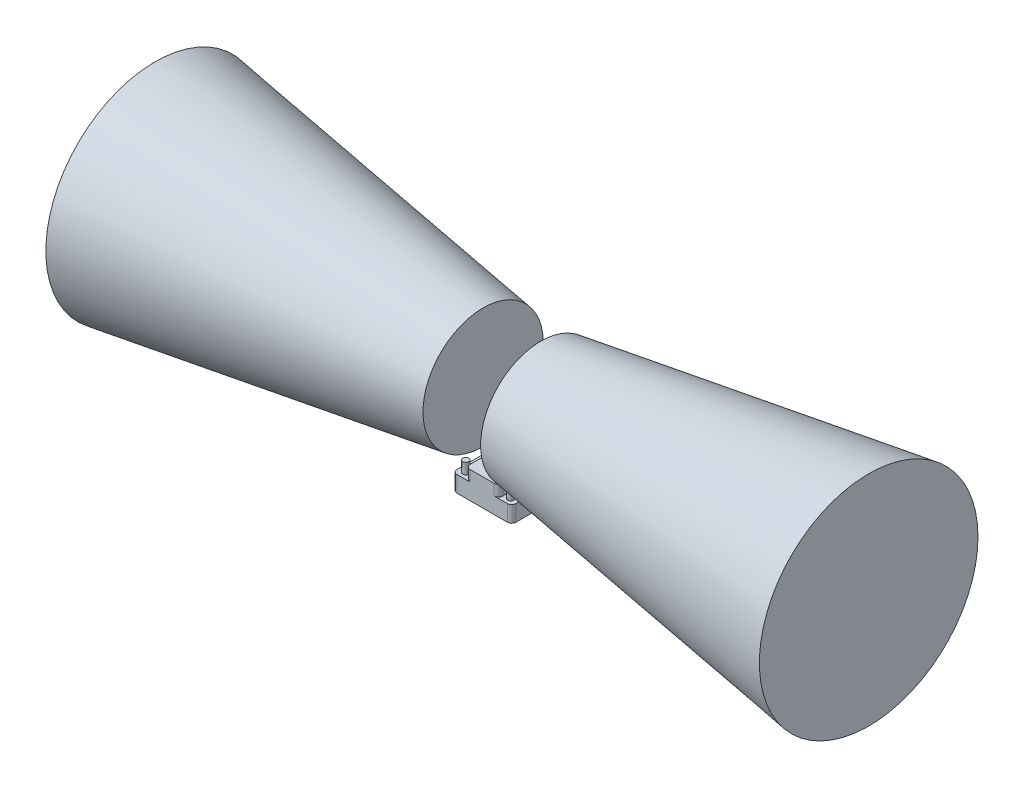
ISO-10303-21;
HEADER;
FILE_DESCRIPTION(('STEP AP214'),'2;1');
FILE_NAME('part.step','',(''),(''),'','','');
FILE_SCHEMA(('AUTOMOTIVE_DESIGN { 1 0 10303 214 1 1 1 1 }'));
ENDSEC;
DATA;
#1=APPLICATION_CONTEXT('core data for automotive mechanical design processes');
#2=APPLICATION_PROTOCOL_DEFINITION('international standard','automotive_design',2000,#1);
#3=PRODUCT_CONTEXT('',#1,'mechanical');
#4=PRODUCT('Part','Part','',(#3));
#5=PRODUCT_RELATED_PRODUCT_CATEGORY('part','',(#4));
#6=PRODUCT_DEFINITION_FORMATION('','',#4);
#7=PRODUCT_DEFINITION_CONTEXT('part definition',#1,'design');
#8=PRODUCT_DEFINITION('design','',#6,#7);
#9=PRODUCT_DEFINITION_SHAPE('','',#8);
#10=(LENGTH_UNIT() NAMED_UNIT(*) SI_UNIT(.MILLI.,.METRE.));
#11=(NAMED_UNIT(*) PLANE_ANGLE_UNIT() SI_UNIT($,.RADIAN.));
#12=(NAMED_UNIT(*) SI_UNIT($,.STERADIAN.) SOLID_ANGLE_UNIT());
#13=UNCERTAINTY_MEASURE_WITH_UNIT(LENGTH_MEASURE(1.E-05),#10,'distance_accuracy_value','');
#14=(GEOMETRIC_REPRESENTATION_CONTEXT(3) GLOBAL_UNCERTAINTY_ASSIGNED_CONTEXT((#13)) GLOBAL_UNIT_ASSIGNED_CONTEXT((#10,
#11,#12)) REPRESENTATION_CONTEXT('',''));
#15=CARTESIAN_POINT('',(0.,0.,0.));
#16=DIRECTION('',(0.,0.,1.));
#17=DIRECTION('',(1.,0.,0.));
#18=AXIS2_PLACEMENT_3D('',#15,#16,#17);
#19=CARTESIAN_POINT('',(26.3746088859546,66.5,10.));
#20=DIRECTION('',(-1.,0.,0.));
#21=DIRECTION('',(0.,0.,1.));
#22=AXIS2_PLACEMENT_3D('',#19,#20,#21);
#23=PLANE('',#22);
#24=CARTESIAN_POINT('',(26.3746088859546,66.5,10.));
#25=DIRECTION('',(1.,0.,0.));
#26=DIRECTION('',(0.,0.,-1.));
#27=AXIS2_PLACEMENT_3D('',#24,#25,#26);
#28=CIRCLE('',#27,55.);
#29=CARTESIAN_POINT('',(26.3746088859546,66.5,-45.));
#30=VERTEX_POINT('',#29);
#31=EDGE_CURVE('E11',#30,#30,#28,.T.);
#32=ORIENTED_EDGE('',*,*,#31,.F.);
#33=EDGE_LOOP('',(#32));
#34=FACE_BOUND('',#33,.T.);
#35=ADVANCED_FACE('F39',(#34),#23,.T.);
#36=CARTESIAN_POINT('',(326.374608885955,66.5,10.));
#37=DIRECTION('',(1.,0.,0.));
#38=DIRECTION('',(0.,0.,-1.));
#39=AXIS2_PLACEMENT_3D('',#36,#37,#38);
#40=CONICAL_SURFACE('',#39,100.,0.148889947609497);
#41=ORIENTED_EDGE('',*,*,#31,.T.);
#42=EDGE_LOOP('',(#41));
#43=FACE_BOUND('',#42,.T.);
#44=CARTESIAN_POINT('',(326.374608885955,66.5,10.));
#45=DIRECTION('',(1.,0.,0.));
#46=DIRECTION('',(0.,0.,-1.));
#47=AXIS2_PLACEMENT_3D('',#44,#45,#46);
#48=CIRCLE('',#47,100.);
#49=CARTESIAN_POINT('',(326.374608885955,66.5,-90.));
#50=VERTEX_POINT('',#49);
#51=EDGE_CURVE('E45',#50,#50,#48,.T.);
#52=ORIENTED_EDGE('',*,*,#51,.F.);
#53=EDGE_LOOP('',(#52));
#54=FACE_BOUND('',#53,.T.);
#55=ADVANCED_FACE('F53',(#43,#54),#40,.T.);
#56=CARTESIAN_POINT('',(326.374608885955,166.5,10.));
#57=DIRECTION('',(1.,0.,0.));
#58=DIRECTION('',(0.,0.,-1.));
#59=AXIS2_PLACEMENT_3D('',#56,#57,#58);
#60=PLANE('',#59);
#61=ORIENTED_EDGE('',*,*,#51,.T.);
#62=EDGE_LOOP('',(#61));
#63=FACE_BOUND('',#62,.T.);
#64=ADVANCED_FACE('F51',(#63),#60,.T.);
#65=CLOSED_SHELL('',(#35,#55,#64));
#66=MANIFOLD_SOLID_BREP('B2',#65);
#67=CARTESIAN_POINT('',(-26.3746088859546,66.5,10.));
#68=DIRECTION('',(1.,0.,0.));
#69=DIRECTION('',(0.,0.,-1.));
#70=AXIS2_PLACEMENT_3D('',#67,#68,#69);
#71=PLANE('',#70);
#72=CARTESIAN_POINT('',(-26.3746088859546,66.5,10.));
#73=DIRECTION('',(1.,0.,0.));
#74=DIRECTION('',(0.,0.,-1.));
#75=AXIS2_PLACEMENT_3D('',#72,#73,#74);
#76=CIRCLE('',#75,55.);
#77=CARTESIAN_POINT('',(-26.3746088859546,66.5,-45.));
#78=VERTEX_POINT('',#77);
#79=EDGE_CURVE('E38',#78,#78,#76,.T.);
#80=ORIENTED_EDGE('',*,*,#79,.T.);
#81=EDGE_LOOP('',(#80));
#82=FACE_BOUND('',#81,.T.);
#83=ADVANCED_FACE('F88',(#82),#71,.T.);
#84=CARTESIAN_POINT('',(-26.3746088859546,66.5,10.));
#85=DIRECTION('',(-1.,0.,0.));
#86=DIRECTION('',(0.,0.,1.));
#87=AXIS2_PLACEMENT_3D('',#84,#85,#86);
#88=CONICAL_SURFACE('',#87,55.,0.148889947609497);
#89=CARTESIAN_POINT('',(-326.374608885955,66.5,10.));
#90=DIRECTION('',(1.,0.,0.));
#91=DIRECTION('',(0.,0.,-1.));
#92=AXIS2_PLACEMENT_3D('',#89,#90,#91);
#93=CIRCLE('',#92,100.);
#94=CARTESIAN_POINT('',(-326.374608885955,66.5,-90.));
#95=VERTEX_POINT('',#94);
#96=EDGE_CURVE('E94',#95,#95,#93,.T.);
#97=ORIENTED_EDGE('',*,*,#96,.T.);
#98=EDGE_LOOP('',(#97));
#99=FACE_BOUND('',#98,.T.);
#100=ORIENTED_EDGE('',*,*,#79,.F.);
#101=EDGE_LOOP('',(#100));
#102=FACE_BOUND('',#101,.T.);
#103=ADVANCED_FACE('F100',(#99,#102),#88,.T.);
#104=CARTESIAN_POINT('',(-326.374608885955,166.5,10.));
#105=DIRECTION('',(-1.,0.,0.));
#106=DIRECTION('',(0.,0.,1.));
#107=AXIS2_PLACEMENT_3D('',#104,#105,#106);
#108=PLANE('',#107);
#109=ORIENTED_EDGE('',*,*,#96,.F.);
#110=EDGE_LOOP('',(#109));
#111=FACE_BOUND('',#110,.T.);
#112=ADVANCED_FACE('F103',(#111),#108,.T.);
#113=CLOSED_SHELL('',(#83,#103,#112));
#114=MANIFOLD_SOLID_BREP('B6',#113);
#115=CARTESIAN_POINT('',(-23.,4.8,33.25));
#116=DIRECTION('',(0.,-1.,0.));
#117=DIRECTION('',(0.,0.,-1.));
#118=AXIS2_PLACEMENT_3D('',#115,#116,#117);
#119=PLANE('',#118);
#120=CARTESIAN_POINT('',(-20.5499999999999,4.8,-21.6250000000001));
#121=DIRECTION('',(0.,-1.,0.));
#122=DIRECTION('',(0.,0.,-1.));
#123=AXIS2_PLACEMENT_3D('',#120,#121,#122);
#124=CIRCLE('',#123,2.74999999999999);
#125=CARTESIAN_POINT('',(-20.5499999999999,4.8,-24.3750000000001));
#126=VERTEX_POINT('',#125);
#127=EDGE_CURVE('E136',#126,#126,#124,.F.);
#128=ORIENTED_EDGE('',*,*,#127,.F.);
#129=EDGE_LOOP('',(#128));
#130=FACE_BOUND('',#129,.T.);
#131=CARTESIAN_POINT('',(-20.5499999999999,4.8,31.6249999999999));
#132=DIRECTION('',(0.,-1.,0.));
#133=DIRECTION('',(0.,0.,-1.));
#134=AXIS2_PLACEMENT_3D('',#131,#132,#133);
#135=CIRCLE('',#134,2.74999999999999);
#136=CARTESIAN_POINT('',(-20.5499999999999,4.8,28.8749999999999));
#137=VERTEX_POINT('',#136);
#138=EDGE_CURVE('E336',#137,#137,#135,.F.);
#139=ORIENTED_EDGE('',*,*,#138,.F.);
#140=EDGE_LOOP('',(#139));
#141=FACE_BOUND('',#140,.T.);
#142=CARTESIAN_POINT('',(-11.,4.8,33.25));
#143=DIRECTION('',(0.,1.,0.));
#144=DIRECTION('',(0.,0.,-1.));
#145=AXIS2_PLACEMENT_3D('',#142,#143,#144);
#146=CIRCLE('',#145,4.);
#147=CARTESIAN_POINT('',(-15.,4.8,33.25));
#148=VERTEX_POINT('',#147);
#149=CARTESIAN_POINT('',(-11.,4.8,37.25));
#150=VERTEX_POINT('',#149);
#151=EDGE_CURVE('E143',#148,#150,#146,.T.);
#152=ORIENTED_EDGE('',*,*,#151,.F.);
#153=DIRECTION('',(0.,0.,1.));
#154=VECTOR('',#153,1.);
#155=CARTESIAN_POINT('',(-15.,4.8,33.25));
#156=LINE('',#155,#154);
#157=CARTESIAN_POINT('',(-15.,4.8,-33.25));
#158=VERTEX_POINT('',#157);
#159=EDGE_CURVE('E147',#158,#148,#156,.T.);
#160=ORIENTED_EDGE('',*,*,#159,.F.);
#161=CARTESIAN_POINT('',(-11.,4.8,-33.25));
#162=DIRECTION('',(0.,1.,0.));
#163=DIRECTION('',(0.,0.,-1.));
#164=AXIS2_PLACEMENT_3D('',#161,#162,#163);
#165=CIRCLE('',#164,4.);
#166=CARTESIAN_POINT('',(-11.,4.8,-37.25));
#167=VERTEX_POINT('',#166);
#168=EDGE_CURVE('E561',#167,#158,#165,.T.);
#169=ORIENTED_EDGE('',*,*,#168,.F.);
#170=DIRECTION('',(-1.,0.,0.));
#171=VECTOR('',#170,1.);
#172=CARTESIAN_POINT('',(-23.,4.8,-37.25));
#173=LINE('',#172,#171);
#174=CARTESIAN_POINT('',(-23.,4.8,-37.25));
#175=VERTEX_POINT('',#174);
#176=EDGE_CURVE('E283',#167,#175,#173,.T.);
#177=ORIENTED_EDGE('',*,*,#176,.T.);
#178=CARTESIAN_POINT('',(-23.,4.8,-33.25));
#179=DIRECTION('',(0.,1.,0.));
#180=DIRECTION('',(0.,0.,-1.));
#181=AXIS2_PLACEMENT_3D('',#178,#179,#180);
#182=CIRCLE('',#181,4.);
#183=CARTESIAN_POINT('',(-27.,4.8,-33.25));
#184=VERTEX_POINT('',#183);
#185=EDGE_CURVE('E286',#175,#184,#182,.T.);
#186=ORIENTED_EDGE('',*,*,#185,.T.);
#187=DIRECTION('',(0.,0.,1.));
#188=VECTOR('',#187,1.);
#189=CARTESIAN_POINT('',(-27.,4.8,33.25));
#190=LINE('',#189,#188);
#191=CARTESIAN_POINT('',(-27.,4.8,33.25));
#192=VERTEX_POINT('',#191);
#193=EDGE_CURVE('E289',#184,#192,#190,.T.);
#194=ORIENTED_EDGE('',*,*,#193,.T.);
#195=CARTESIAN_POINT('',(-23.,4.8,33.25));
#196=DIRECTION('',(0.,1.,0.));
#197=DIRECTION('',(0.,0.,-1.));
#198=AXIS2_PLACEMENT_3D('',#195,#196,#197);
#199=CIRCLE('',#198,4.);
#200=CARTESIAN_POINT('',(-23.,4.8,37.25));
#201=VERTEX_POINT('',#200);
#202=EDGE_CURVE('E263',#192,#201,#199,.T.);
#203=ORIENTED_EDGE('',*,*,#202,.T.);
#204=DIRECTION('',(1.,0.,0.));
#205=VECTOR('',#204,1.);
#206=CARTESIAN_POINT('',(-23.,4.8,37.25));
#207=LINE('',#206,#205);
#208=EDGE_CURVE('E272',#201,#150,#207,.T.);
#209=ORIENTED_EDGE('',*,*,#208,.T.);
#210=EDGE_LOOP('',(#152,#160,#169,#177,#186,#194,#203,#209));
#211=FACE_BOUND('',#210,.T.);
#212=ADVANCED_FACE('F128',(#130,#141,#211),#119,.F.);
#213=CARTESIAN_POINT('',(-23.,-10.,33.25));
#214=DIRECTION('',(0.,1.,0.));
#215=DIRECTION('',(0.,0.,1.));
#216=AXIS2_PLACEMENT_3D('',#213,#214,#215);
#217=CYLINDRICAL_SURFACE('',#216,4.);
#218=DIRECTION('',(0.,1.,0.));
#219=VECTOR('',#218,1.);
#220=CARTESIAN_POINT('',(-23.,-10.,37.25));
#221=LINE('',#220,#219);
#222=CARTESIAN_POINT('',(-23.,-10.,37.25));
#223=VERTEX_POINT('',#222);
#224=EDGE_CURVE('E316',#223,#201,#221,.T.);
#225=ORIENTED_EDGE('',*,*,#224,.T.);
#226=ORIENTED_EDGE('',*,*,#202,.F.);
#227=DIRECTION('',(0.,1.,0.));
#228=VECTOR('',#227,1.);
#229=CARTESIAN_POINT('',(-27.,-10.,33.25));
#230=LINE('',#229,#228);
#231=CARTESIAN_POINT('',(-27.,-10.,33.25));
#232=VERTEX_POINT('',#231);
#233=EDGE_CURVE('E317',#232,#192,#230,.T.);
#234=ORIENTED_EDGE('',*,*,#233,.F.);
#235=CARTESIAN_POINT('',(-23.,-10.,33.25));
#236=DIRECTION('',(0.,1.,0.));
#237=DIRECTION('',(0.,0.,-1.));
#238=AXIS2_PLACEMENT_3D('',#235,#236,#237);
#239=CIRCLE('',#238,4.);
#240=EDGE_CURVE('E292',#232,#223,#239,.T.);
#241=ORIENTED_EDGE('',*,*,#240,.T.);
#242=EDGE_LOOP('',(#225,#226,#234,#241));
#243=FACE_BOUND('',#242,.T.);
#244=ADVANCED_FACE('F130',(#243),#217,.T.);
#245=CARTESIAN_POINT('',(-27.,-10.,33.25));
#246=DIRECTION('',(-1.,0.,0.));
#247=DIRECTION('',(0.,0.,1.));
#248=AXIS2_PLACEMENT_3D('',#245,#246,#247);
#249=PLANE('',#248);
#250=ORIENTED_EDGE('',*,*,#233,.T.);
#251=ORIENTED_EDGE('',*,*,#193,.F.);
#252=DIRECTION('',(0.,1.,0.));
#253=VECTOR('',#252,1.);
#254=CARTESIAN_POINT('',(-27.,-10.,-33.25));
#255=LINE('',#254,#253);
#256=CARTESIAN_POINT('',(-27.,-10.,-33.25));
#257=VERTEX_POINT('',#256);
#258=EDGE_CURVE('E320',#257,#184,#255,.T.);
#259=ORIENTED_EDGE('',*,*,#258,.F.);
#260=DIRECTION('',(0.,0.,1.));
#261=VECTOR('',#260,1.);
#262=CARTESIAN_POINT('',(-27.,-10.,33.25));
#263=LINE('',#262,#261);
#264=EDGE_CURVE('E313',#257,#232,#263,.T.);
#265=ORIENTED_EDGE('',*,*,#264,.T.);
#266=EDGE_LOOP('',(#250,#251,#259,#265));
#267=FACE_BOUND('',#266,.T.);
#268=ADVANCED_FACE('F400',(#267),#249,.T.);
#269=CARTESIAN_POINT('',(-23.,-10.,-33.25));
#270=DIRECTION('',(0.,1.,0.));
#271=DIRECTION('',(0.,0.,1.));
#272=AXIS2_PLACEMENT_3D('',#269,#270,#271);
#273=CYLINDRICAL_SURFACE('',#272,4.);
#274=ORIENTED_EDGE('',*,*,#258,.T.);
#275=ORIENTED_EDGE('',*,*,#185,.F.);
#276=DIRECTION('',(0.,1.,0.));
#277=VECTOR('',#276,1.);
#278=CARTESIAN_POINT('',(-23.,-10.,-37.25));
#279=LINE('',#278,#277);
#280=CARTESIAN_POINT('',(-23.,-10.,-37.25));
#281=VERTEX_POINT('',#280);
#282=EDGE_CURVE('E322',#281,#175,#279,.T.);
#283=ORIENTED_EDGE('',*,*,#282,.F.);
#284=CARTESIAN_POINT('',(-23.,-10.,-33.25));
#285=DIRECTION('',(0.,1.,0.));
#286=DIRECTION('',(0.,0.,-1.));
#287=AXIS2_PLACEMENT_3D('',#284,#285,#286);
#288=CIRCLE('',#287,4.);
#289=EDGE_CURVE('E310',#281,#257,#288,.T.);
#290=ORIENTED_EDGE('',*,*,#289,.T.);
#291=EDGE_LOOP('',(#274,#275,#283,#290));
#292=FACE_BOUND('',#291,.T.);
#293=ADVANCED_FACE('F403',(#292),#273,.T.);
#294=CARTESIAN_POINT('',(-23.,-10.,-37.25));
#295=DIRECTION('',(0.,0.,-1.));
#296=DIRECTION('',(-1.,0.,0.));
#297=AXIS2_PLACEMENT_3D('',#294,#295,#296);
#298=PLANE('',#297);
#299=ORIENTED_EDGE('',*,*,#282,.T.);
#300=ORIENTED_EDGE('',*,*,#176,.F.);
#301=DIRECTION('',(0.,-1.,0.));
#302=VECTOR('',#301,1.);
#303=CARTESIAN_POINT('',(-11.,14.8,-37.25));
#304=LINE('',#303,#302);
#305=CARTESIAN_POINT('',(-11.,14.8,-37.25));
#306=VERTEX_POINT('',#305);
#307=EDGE_CURVE('E568',#306,#167,#304,.T.);
#308=ORIENTED_EDGE('',*,*,#307,.F.);
#309=DIRECTION('',(-1.,0.,0.));
#310=VECTOR('',#309,1.);
#311=CARTESIAN_POINT('',(-11.,14.8,-37.25));
#312=LINE('',#311,#310);
#313=CARTESIAN_POINT('',(11.,14.8,-37.25));
#314=VERTEX_POINT('',#313);
#315=EDGE_CURVE('E545',#314,#306,#312,.T.);
#316=ORIENTED_EDGE('',*,*,#315,.F.);
#317=DIRECTION('',(0.,-1.,0.));
#318=VECTOR('',#317,1.);
#319=CARTESIAN_POINT('',(11.,14.8,-37.25));
#320=LINE('',#319,#318);
#321=CARTESIAN_POINT('',(11.,4.8,-37.25));
#322=VERTEX_POINT('',#321);
#323=EDGE_CURVE('E571',#314,#322,#320,.T.);
#324=ORIENTED_EDGE('',*,*,#323,.T.);
#325=CARTESIAN_POINT('',(23.,4.8,-37.25));
#326=VERTEX_POINT('',#325);
#327=EDGE_CURVE('E284',#326,#322,#173,.T.);
#328=ORIENTED_EDGE('',*,*,#327,.F.);
#329=DIRECTION('',(0.,1.,0.));
#330=VECTOR('',#329,1.);
#331=CARTESIAN_POINT('',(23.,-10.,-37.25));
#332=LINE('',#331,#330);
#333=CARTESIAN_POINT('',(23.,-10.,-37.25));
#334=VERTEX_POINT('',#333);
#335=EDGE_CURVE('E325',#334,#326,#332,.T.);
#336=ORIENTED_EDGE('',*,*,#335,.F.);
#337=DIRECTION('',(-1.,0.,0.));
#338=VECTOR('',#337,1.);
#339=CARTESIAN_POINT('',(-23.,-10.,-37.25));
#340=LINE('',#339,#338);
#341=EDGE_CURVE('E307',#334,#281,#340,.T.);
#342=ORIENTED_EDGE('',*,*,#341,.T.);
#343=EDGE_LOOP('',(#299,#300,#308,#316,#324,#328,#336,#342));
#344=FACE_BOUND('',#343,.T.);
#345=ADVANCED_FACE('F407',(#344),#298,.T.);
#346=CARTESIAN_POINT('',(23.,-10.,-33.25));
#347=DIRECTION('',(0.,1.,0.));
#348=DIRECTION('',(0.,0.,1.));
#349=AXIS2_PLACEMENT_3D('',#346,#347,#348);
#350=CYLINDRICAL_SURFACE('',#349,4.);
#351=ORIENTED_EDGE('',*,*,#335,.T.);
#352=CARTESIAN_POINT('',(23.,4.8,-33.25));
#353=DIRECTION('',(0.,1.,0.));
#354=DIRECTION('',(0.,0.,-1.));
#355=AXIS2_PLACEMENT_3D('',#352,#353,#354);
#356=CIRCLE('',#355,4.);
#357=CARTESIAN_POINT('',(27.,4.8,-33.25));
#358=VERTEX_POINT('',#357);
#359=EDGE_CURVE('E280',#358,#326,#356,.T.);
#360=ORIENTED_EDGE('',*,*,#359,.F.);
#361=DIRECTION('',(0.,1.,0.));
#362=VECTOR('',#361,1.);
#363=CARTESIAN_POINT('',(27.,-10.,-33.25));
#364=LINE('',#363,#362);
#365=CARTESIAN_POINT('',(27.,-10.,-33.25));
#366=VERTEX_POINT('',#365);
#367=EDGE_CURVE('E327',#366,#358,#364,.T.);
#368=ORIENTED_EDGE('',*,*,#367,.F.);
#369=CARTESIAN_POINT('',(23.,-10.,-33.25));
#370=DIRECTION('',(0.,1.,0.));
#371=DIRECTION('',(0.,0.,-1.));
#372=AXIS2_PLACEMENT_3D('',#369,#370,#371);
#373=CIRCLE('',#372,4.);
#374=EDGE_CURVE('E304',#366,#334,#373,.T.);
#375=ORIENTED_EDGE('',*,*,#374,.T.);
#376=EDGE_LOOP('',(#351,#360,#368,#375));
#377=FACE_BOUND('',#376,.T.);
#378=ADVANCED_FACE('F411',(#377),#350,.T.);
#379=CARTESIAN_POINT('',(27.,-10.,33.25));
#380=DIRECTION('',(1.,0.,0.));
#381=DIRECTION('',(0.,0.,-1.));
#382=AXIS2_PLACEMENT_3D('',#379,#380,#381);
#383=PLANE('',#382);
#384=ORIENTED_EDGE('',*,*,#367,.T.);
#385=DIRECTION('',(0.,0.,-1.));
#386=VECTOR('',#385,1.);
#387=CARTESIAN_POINT('',(27.,4.8,33.25));
#388=LINE('',#387,#386);
#389=CARTESIAN_POINT('',(27.,4.8,33.25));
#390=VERTEX_POINT('',#389);
#391=EDGE_CURVE('E277',#390,#358,#388,.T.);
#392=ORIENTED_EDGE('',*,*,#391,.F.);
#393=DIRECTION('',(0.,1.,0.));
#394=VECTOR('',#393,1.);
#395=CARTESIAN_POINT('',(27.,-10.,33.25));
#396=LINE('',#395,#394);
#397=CARTESIAN_POINT('',(27.,-10.,33.25));
#398=VERTEX_POINT('',#397);
#399=EDGE_CURVE('E329',#398,#390,#396,.T.);
#400=ORIENTED_EDGE('',*,*,#399,.F.);
#401=DIRECTION('',(0.,0.,-1.));
#402=VECTOR('',#401,1.);
#403=CARTESIAN_POINT('',(27.,-10.,33.25));
#404=LINE('',#403,#402);
#405=EDGE_CURVE('E301',#398,#366,#404,.T.);
#406=ORIENTED_EDGE('',*,*,#405,.T.);
#407=EDGE_LOOP('',(#384,#392,#400,#406));
#408=FACE_BOUND('',#407,.T.);
#409=ADVANCED_FACE('F415',(#408),#383,.T.);
#410=CARTESIAN_POINT('',(23.,-10.,33.25));
#411=DIRECTION('',(0.,1.,0.));
#412=DIRECTION('',(0.,0.,1.));
#413=AXIS2_PLACEMENT_3D('',#410,#411,#412);
#414=CYLINDRICAL_SURFACE('',#413,4.);
#415=ORIENTED_EDGE('',*,*,#399,.T.);
#416=CARTESIAN_POINT('',(23.,4.8,33.25));
#417=DIRECTION('',(0.,1.,0.));
#418=DIRECTION('',(0.,0.,1.));
#419=AXIS2_PLACEMENT_3D('',#416,#417,#418);
#420=CIRCLE('',#419,4.);
#421=CARTESIAN_POINT('',(23.,4.8,37.25));
#422=VERTEX_POINT('',#421);
#423=EDGE_CURVE('E274',#422,#390,#420,.T.);
#424=ORIENTED_EDGE('',*,*,#423,.F.);
#425=DIRECTION('',(0.,1.,0.));
#426=VECTOR('',#425,1.);
#427=CARTESIAN_POINT('',(23.,-10.,37.25));
#428=LINE('',#427,#426);
#429=CARTESIAN_POINT('',(23.,-10.,37.25));
#430=VERTEX_POINT('',#429);
#431=EDGE_CURVE('E331',#430,#422,#428,.T.);
#432=ORIENTED_EDGE('',*,*,#431,.F.);
#433=CARTESIAN_POINT('',(23.,-10.,33.25));
#434=DIRECTION('',(0.,1.,0.));
#435=DIRECTION('',(0.,0.,1.));
#436=AXIS2_PLACEMENT_3D('',#433,#434,#435);
#437=CIRCLE('',#436,4.);
#438=EDGE_CURVE('E298',#430,#398,#437,.T.);
#439=ORIENTED_EDGE('',*,*,#438,.T.);
#440=EDGE_LOOP('',(#415,#424,#432,#439));
#441=FACE_BOUND('',#440,.T.);
#442=ADVANCED_FACE('F419',(#441),#414,.T.);
#443=CARTESIAN_POINT('',(-23.,-10.,37.25));
#444=DIRECTION('',(0.,0.,1.));
#445=DIRECTION('',(1.,0.,0.));
#446=AXIS2_PLACEMENT_3D('',#443,#444,#445);
#447=PLANE('',#446);
#448=ORIENTED_EDGE('',*,*,#431,.T.);
#449=CARTESIAN_POINT('',(11.,4.8,37.25));
#450=VERTEX_POINT('',#449);
#451=EDGE_CURVE('E266',#450,#422,#207,.T.);
#452=ORIENTED_EDGE('',*,*,#451,.F.);
#453=DIRECTION('',(0.,-1.,0.));
#454=VECTOR('',#453,1.);
#455=CARTESIAN_POINT('',(11.,14.8,37.25));
#456=LINE('',#455,#454);
#457=CARTESIAN_POINT('',(11.,14.8,37.25));
#458=VERTEX_POINT('',#457);
#459=EDGE_CURVE('E248',#458,#450,#456,.T.);
#460=ORIENTED_EDGE('',*,*,#459,.F.);
#461=DIRECTION('',(1.,0.,0.));
#462=VECTOR('',#461,1.);
#463=CARTESIAN_POINT('',(-11.,14.8,37.25));
#464=LINE('',#463,#462);
#465=CARTESIAN_POINT('',(-11.,14.8,37.25));
#466=VERTEX_POINT('',#465);
#467=EDGE_CURVE('E239',#466,#458,#464,.T.);
#468=ORIENTED_EDGE('',*,*,#467,.F.);
#469=DIRECTION('',(0.,-1.,0.));
#470=VECTOR('',#469,1.);
#471=CARTESIAN_POINT('',(-11.,14.8,37.25));
#472=LINE('',#471,#470);
#473=EDGE_CURVE('E245',#466,#150,#472,.T.);
#474=ORIENTED_EDGE('',*,*,#473,.T.);
#475=ORIENTED_EDGE('',*,*,#208,.F.);
#476=ORIENTED_EDGE('',*,*,#224,.F.);
#477=DIRECTION('',(1.,0.,0.));
#478=VECTOR('',#477,1.);
#479=CARTESIAN_POINT('',(-23.,-10.,37.25));
#480=LINE('',#479,#478);
#481=EDGE_CURVE('E295',#223,#430,#480,.T.);
#482=ORIENTED_EDGE('',*,*,#481,.T.);
#483=EDGE_LOOP('',(#448,#452,#460,#468,#474,#475,#476,#482));
#484=FACE_BOUND('',#483,.T.);
#485=ADVANCED_FACE('F242',(#484),#447,.T.);
#486=CARTESIAN_POINT('',(-23.,-10.,33.25));
#487=DIRECTION('',(0.,-1.,0.));
#488=DIRECTION('',(0.,0.,-1.));
#489=AXIS2_PLACEMENT_3D('',#486,#487,#488);
#490=PLANE('',#489);
#491=ORIENTED_EDGE('',*,*,#240,.F.);
#492=ORIENTED_EDGE('',*,*,#264,.F.);
#493=ORIENTED_EDGE('',*,*,#289,.F.);
#494=ORIENTED_EDGE('',*,*,#341,.F.);
#495=ORIENTED_EDGE('',*,*,#374,.F.);
#496=ORIENTED_EDGE('',*,*,#405,.F.);
#497=ORIENTED_EDGE('',*,*,#438,.F.);
#498=ORIENTED_EDGE('',*,*,#481,.F.);
#499=EDGE_LOOP('',(#491,#492,#493,#494,#495,#496,#497,#498));
#500=FACE_BOUND('',#499,.T.);
#501=ADVANCED_FACE('F395',(#500),#490,.T.);
#502=CARTESIAN_POINT('',(20.5500000000002,4.8,-21.6250000000001));
#503=DIRECTION('',(0.,-1.,0.));
#504=DIRECTION('',(0.,0.,-1.));
#505=AXIS2_PLACEMENT_3D('',#502,#503,#504);
#506=CIRCLE('',#505,2.74999999999998);
#507=CARTESIAN_POINT('',(20.5500000000002,4.8,-24.3750000000001));
#508=VERTEX_POINT('',#507);
#509=EDGE_CURVE('E86',#508,#508,#506,.F.);
#510=ORIENTED_EDGE('',*,*,#509,.F.);
#511=EDGE_LOOP('',(#510));
#512=FACE_BOUND('',#511,.T.);
#513=CARTESIAN_POINT('',(20.5500000000002,4.8,31.6249999999999));
#514=DIRECTION('',(0.,-1.,0.));
#515=DIRECTION('',(0.,0.,-1.));
#516=AXIS2_PLACEMENT_3D('',#513,#514,#515);
#517=CIRCLE('',#516,2.74999999999998);
#518=CARTESIAN_POINT('',(20.5500000000002,4.8,28.8749999999999));
#519=VERTEX_POINT('',#518);
#520=EDGE_CURVE('E319',#519,#519,#517,.F.);
#521=ORIENTED_EDGE('',*,*,#520,.F.);
#522=EDGE_LOOP('',(#521));
#523=FACE_BOUND('',#522,.T.);
#524=CARTESIAN_POINT('',(11.,4.8,-33.25));
#525=DIRECTION('',(0.,1.,0.));
#526=DIRECTION('',(0.,0.,-1.));
#527=AXIS2_PLACEMENT_3D('',#524,#525,#526);
#528=CIRCLE('',#527,4.);
#529=CARTESIAN_POINT('',(15.,4.8,-33.25));
#530=VERTEX_POINT('',#529);
#531=EDGE_CURVE('E558',#530,#322,#528,.T.);
#532=ORIENTED_EDGE('',*,*,#531,.F.);
#533=DIRECTION('',(0.,0.,-1.));
#534=VECTOR('',#533,1.);
#535=CARTESIAN_POINT('',(15.,4.8,33.25));
#536=LINE('',#535,#534);
#537=CARTESIAN_POINT('',(15.,4.8,33.25));
#538=VERTEX_POINT('',#537);
#539=EDGE_CURVE('E555',#538,#530,#536,.T.);
#540=ORIENTED_EDGE('',*,*,#539,.F.);
#541=CARTESIAN_POINT('',(11.,4.8,33.25));
#542=DIRECTION('',(0.,1.,0.));
#543=DIRECTION('',(0.,0.,1.));
#544=AXIS2_PLACEMENT_3D('',#541,#542,#543);
#545=CIRCLE('',#544,4.);
#546=EDGE_CURVE('E552',#450,#538,#545,.T.);
#547=ORIENTED_EDGE('',*,*,#546,.F.);
#548=ORIENTED_EDGE('',*,*,#451,.T.);
#549=ORIENTED_EDGE('',*,*,#423,.T.);
#550=ORIENTED_EDGE('',*,*,#391,.T.);
#551=ORIENTED_EDGE('',*,*,#359,.T.);
#552=ORIENTED_EDGE('',*,*,#327,.T.);
#553=EDGE_LOOP('',(#532,#540,#547,#548,#549,#550,#551,#552));
#554=FACE_BOUND('',#553,.T.);
#555=ADVANCED_FACE('F346',(#512,#523,#554),#119,.F.);
#556=CARTESIAN_POINT('',(-11.,14.8,33.25));
#557=DIRECTION('',(0.,-1.,0.));
#558=DIRECTION('',(0.,0.,-1.));
#559=AXIS2_PLACEMENT_3D('',#556,#557,#558);
#560=CYLINDRICAL_SURFACE('',#559,4.);
#561=ORIENTED_EDGE('',*,*,#151,.T.);
#562=ORIENTED_EDGE('',*,*,#473,.F.);
#563=CARTESIAN_POINT('',(-11.,14.8,33.25));
#564=DIRECTION('',(0.,1.,0.));
#565=DIRECTION('',(0.,0.,-1.));
#566=AXIS2_PLACEMENT_3D('',#563,#564,#565);
#567=CIRCLE('',#566,4.);
#568=CARTESIAN_POINT('',(-15.,14.8,33.25));
#569=VERTEX_POINT('',#568);
#570=EDGE_CURVE('E252',#569,#466,#567,.T.);
#571=ORIENTED_EDGE('',*,*,#570,.F.);
#572=DIRECTION('',(0.,-1.,0.));
#573=VECTOR('',#572,1.);
#574=CARTESIAN_POINT('',(-15.,14.8,33.25));
#575=LINE('',#574,#573);
#576=EDGE_CURVE('E550',#569,#148,#575,.T.);
#577=ORIENTED_EDGE('',*,*,#576,.T.);
#578=EDGE_LOOP('',(#561,#562,#571,#577));
#579=FACE_BOUND('',#578,.T.);
#580=ADVANCED_FACE('F262',(#579),#560,.T.);
#581=CARTESIAN_POINT('',(11.,14.8,33.25));
#582=DIRECTION('',(0.,-1.,0.));
#583=DIRECTION('',(0.,0.,-1.));
#584=AXIS2_PLACEMENT_3D('',#581,#582,#583);
#585=CYLINDRICAL_SURFACE('',#584,4.);
#586=ORIENTED_EDGE('',*,*,#546,.T.);
#587=DIRECTION('',(0.,-1.,0.));
#588=VECTOR('',#587,1.);
#589=CARTESIAN_POINT('',(15.,14.8,33.25));
#590=LINE('',#589,#588);
#591=CARTESIAN_POINT('',(15.,14.8,33.25));
#592=VERTEX_POINT('',#591);
#593=EDGE_CURVE('E268',#592,#538,#590,.T.);
#594=ORIENTED_EDGE('',*,*,#593,.F.);
#595=CARTESIAN_POINT('',(11.,14.8,33.25));
#596=DIRECTION('',(0.,1.,0.));
#597=DIRECTION('',(0.,0.,1.));
#598=AXIS2_PLACEMENT_3D('',#595,#596,#597);
#599=CIRCLE('',#598,4.);
#600=EDGE_CURVE('E251',#458,#592,#599,.T.);
#601=ORIENTED_EDGE('',*,*,#600,.F.);
#602=ORIENTED_EDGE('',*,*,#459,.T.);
#603=EDGE_LOOP('',(#586,#594,#601,#602));
#604=FACE_BOUND('',#603,.T.);
#605=ADVANCED_FACE('F387',(#604),#585,.T.);
#606=CARTESIAN_POINT('',(15.,14.8,33.25));
#607=DIRECTION('',(-1.,0.,0.));
#608=DIRECTION('',(0.,0.,1.));
#609=AXIS2_PLACEMENT_3D('',#606,#607,#608);
#610=PLANE('',#609);
#611=ORIENTED_EDGE('',*,*,#539,.T.);
#612=DIRECTION('',(0.,-1.,0.));
#613=VECTOR('',#612,1.);
#614=CARTESIAN_POINT('',(15.,14.8,-33.25));
#615=LINE('',#614,#613);
#616=CARTESIAN_POINT('',(15.,14.8,-33.25));
#617=VERTEX_POINT('',#616);
#618=EDGE_CURVE('E574',#617,#530,#615,.T.);
#619=ORIENTED_EDGE('',*,*,#618,.F.);
#620=DIRECTION('',(0.,0.,-1.));
#621=VECTOR('',#620,1.);
#622=CARTESIAN_POINT('',(15.,14.8,33.25));
#623=LINE('',#622,#621);
#624=EDGE_CURVE('E541',#592,#617,#623,.T.);
#625=ORIENTED_EDGE('',*,*,#624,.F.);
#626=ORIENTED_EDGE('',*,*,#593,.T.);
#627=EDGE_LOOP('',(#611,#619,#625,#626));
#628=FACE_BOUND('',#627,.T.);
#629=ADVANCED_FACE('F383',(#628),#610,.F.);
#630=CARTESIAN_POINT('',(11.,14.8,-33.25));
#631=DIRECTION('',(0.,-1.,0.));
#632=DIRECTION('',(0.,0.,-1.));
#633=AXIS2_PLACEMENT_3D('',#630,#631,#632);
#634=CYLINDRICAL_SURFACE('',#633,4.);
#635=ORIENTED_EDGE('',*,*,#531,.T.);
#636=ORIENTED_EDGE('',*,*,#323,.F.);
#637=CARTESIAN_POINT('',(11.,14.8,-33.25));
#638=DIRECTION('',(0.,1.,0.));
#639=DIRECTION('',(0.,0.,-1.));
#640=AXIS2_PLACEMENT_3D('',#637,#638,#639);
#641=CIRCLE('',#640,4.);
#642=EDGE_CURVE('E543',#617,#314,#641,.T.);
#643=ORIENTED_EDGE('',*,*,#642,.F.);
#644=ORIENTED_EDGE('',*,*,#618,.T.);
#645=EDGE_LOOP('',(#635,#636,#643,#644));
#646=FACE_BOUND('',#645,.T.);
#647=ADVANCED_FACE('F379',(#646),#634,.T.);
#648=CARTESIAN_POINT('',(-11.,14.8,-33.25));
#649=DIRECTION('',(0.,-1.,0.));
#650=DIRECTION('',(0.,0.,-1.));
#651=AXIS2_PLACEMENT_3D('',#648,#649,#650);
#652=CYLINDRICAL_SURFACE('',#651,4.);
#653=ORIENTED_EDGE('',*,*,#168,.T.);
#654=DIRECTION('',(0.,-1.,0.));
#655=VECTOR('',#654,1.);
#656=CARTESIAN_POINT('',(-15.,14.8,-33.25));
#657=LINE('',#656,#655);
#658=CARTESIAN_POINT('',(-15.,14.8,-33.25));
#659=VERTEX_POINT('',#658);
#660=EDGE_CURVE('E565',#659,#158,#657,.T.);
#661=ORIENTED_EDGE('',*,*,#660,.F.);
#662=CARTESIAN_POINT('',(-11.,14.8,-33.25));
#663=DIRECTION('',(0.,1.,0.));
#664=DIRECTION('',(0.,0.,-1.));
#665=AXIS2_PLACEMENT_3D('',#662,#663,#664);
#666=CIRCLE('',#665,4.);
#667=EDGE_CURVE('E547',#306,#659,#666,.T.);
#668=ORIENTED_EDGE('',*,*,#667,.F.);
#669=ORIENTED_EDGE('',*,*,#307,.T.);
#670=EDGE_LOOP('',(#653,#661,#668,#669));
#671=FACE_BOUND('',#670,.T.);
#672=ADVANCED_FACE('F375',(#671),#652,.T.);
#673=CARTESIAN_POINT('',(-15.,14.8,33.25));
#674=DIRECTION('',(1.,0.,0.));
#675=DIRECTION('',(0.,0.,-1.));
#676=AXIS2_PLACEMENT_3D('',#673,#674,#675);
#677=PLANE('',#676);
#678=ORIENTED_EDGE('',*,*,#159,.T.);
#679=ORIENTED_EDGE('',*,*,#576,.F.);
#680=DIRECTION('',(0.,0.,1.));
#681=VECTOR('',#680,1.);
#682=CARTESIAN_POINT('',(-15.,14.8,33.25));
#683=LINE('',#682,#681);
#684=EDGE_CURVE('E257',#659,#569,#683,.T.);
#685=ORIENTED_EDGE('',*,*,#684,.F.);
#686=ORIENTED_EDGE('',*,*,#660,.T.);
#687=EDGE_LOOP('',(#678,#679,#685,#686));
#688=FACE_BOUND('',#687,.T.);
#689=ADVANCED_FACE('F372',(#688),#677,.F.);
#690=CARTESIAN_POINT('',(-11.,14.8,33.25));
#691=DIRECTION('',(0.,-1.,0.));
#692=DIRECTION('',(0.,0.,-1.));
#693=AXIS2_PLACEMENT_3D('',#690,#691,#692);
#694=PLANE('',#693);
#695=ORIENTED_EDGE('',*,*,#570,.T.);
#696=ORIENTED_EDGE('',*,*,#467,.T.);
#697=ORIENTED_EDGE('',*,*,#600,.T.);
#698=ORIENTED_EDGE('',*,*,#624,.T.);
#699=ORIENTED_EDGE('',*,*,#642,.T.);
#700=ORIENTED_EDGE('',*,*,#315,.T.);
#701=ORIENTED_EDGE('',*,*,#667,.T.);
#702=ORIENTED_EDGE('',*,*,#684,.T.);
#703=EDGE_LOOP('',(#695,#696,#697,#698,#699,#700,#701,#702));
#704=FACE_BOUND('',#703,.T.);
#705=ADVANCED_FACE('F255',(#704),#694,.F.);
#706=CARTESIAN_POINT('',(20.5500000000002,14.8,31.6249999999999));
#707=DIRECTION('',(0.,-1.,0.));
#708=DIRECTION('',(0.,0.,-1.));
#709=AXIS2_PLACEMENT_3D('',#706,#707,#708);
#710=CYLINDRICAL_SURFACE('',#709,2.74999999999998);
#711=CARTESIAN_POINT('',(20.5500000000002,14.8,31.6249999999999));
#712=DIRECTION('',(0.,1.,0.));
#713=DIRECTION('',(0.,0.,1.));
#714=AXIS2_PLACEMENT_3D('',#711,#712,#713);
#715=CIRCLE('',#714,2.74999999999998);
#716=CARTESIAN_POINT('',(20.5500000000002,14.8,34.3749999999998));
#717=VERTEX_POINT('',#716);
#718=EDGE_CURVE('E537',#717,#717,#715,.T.);
#719=ORIENTED_EDGE('',*,*,#718,.F.);
#720=EDGE_LOOP('',(#719));
#721=FACE_BOUND('',#720,.T.);
#722=ORIENTED_EDGE('',*,*,#520,.T.);
#723=EDGE_LOOP('',(#722));
#724=FACE_BOUND('',#723,.T.);
#725=ADVANCED_FACE('F361',(#721,#724),#710,.T.);
#726=CARTESIAN_POINT('',(20.5500000000002,14.8,31.6249999999999));
#727=DIRECTION('',(0.,1.,0.));
#728=DIRECTION('',(0.,0.,1.));
#729=AXIS2_PLACEMENT_3D('',#726,#727,#728);
#730=PLANE('',#729);
#731=ORIENTED_EDGE('',*,*,#718,.T.);
#732=EDGE_LOOP('',(#731));
#733=FACE_BOUND('',#732,.T.);
#734=ADVANCED_FACE('F352',(#733),#730,.T.);
#735=CARTESIAN_POINT('',(-20.5499999999999,14.8,31.6249999999999));
#736=DIRECTION('',(0.,-1.,0.));
#737=DIRECTION('',(0.,0.,-1.));
#738=AXIS2_PLACEMENT_3D('',#735,#736,#737);
#739=CYLINDRICAL_SURFACE('',#738,2.74999999999999);
#740=CARTESIAN_POINT('',(-20.5499999999999,14.8,31.6249999999999));
#741=DIRECTION('',(0.,1.,0.));
#742=DIRECTION('',(0.,0.,1.));
#743=AXIS2_PLACEMENT_3D('',#740,#741,#742);
#744=CIRCLE('',#743,2.74999999999999);
#745=CARTESIAN_POINT('',(-20.5499999999999,14.8,34.3749999999999));
#746=VERTEX_POINT('',#745);
#747=EDGE_CURVE('E532',#746,#746,#744,.T.);
#748=ORIENTED_EDGE('',*,*,#747,.F.);
#749=EDGE_LOOP('',(#748));
#750=FACE_BOUND('',#749,.T.);
#751=ORIENTED_EDGE('',*,*,#138,.T.);
#752=EDGE_LOOP('',(#751));
#753=FACE_BOUND('',#752,.T.);
#754=ADVANCED_FACE('F349',(#750,#753),#739,.T.);
#755=CARTESIAN_POINT('',(-20.5499999999999,14.8,31.6249999999999));
#756=DIRECTION('',(0.,1.,0.));
#757=DIRECTION('',(0.,0.,1.));
#758=AXIS2_PLACEMENT_3D('',#755,#756,#757);
#759=PLANE('',#758);
#760=ORIENTED_EDGE('',*,*,#747,.T.);
#761=EDGE_LOOP('',(#760));
#762=FACE_BOUND('',#761,.T.);
#763=ADVANCED_FACE('F351',(#762),#759,.T.);
#764=CARTESIAN_POINT('',(-20.5499999999999,14.8,-21.6250000000001));
#765=DIRECTION('',(0.,-1.,0.));
#766=DIRECTION('',(0.,0.,-1.));
#767=AXIS2_PLACEMENT_3D('',#764,#765,#766);
#768=CYLINDRICAL_SURFACE('',#767,2.74999999999999);
#769=CARTESIAN_POINT('',(-20.5499999999999,14.8,-21.6250000000001));
#770=DIRECTION('',(0.,1.,0.));
#771=DIRECTION('',(0.,0.,1.));
#772=AXIS2_PLACEMENT_3D('',#769,#770,#771);
#773=CIRCLE('',#772,2.74999999999999);
#774=CARTESIAN_POINT('',(-20.5499999999999,14.8,-18.8750000000002));
#775=VERTEX_POINT('',#774);
#776=EDGE_CURVE('E529',#775,#775,#773,.T.);
#777=ORIENTED_EDGE('',*,*,#776,.F.);
#778=EDGE_LOOP('',(#777));
#779=FACE_BOUND('',#778,.T.);
#780=ORIENTED_EDGE('',*,*,#127,.T.);
#781=EDGE_LOOP('',(#780));
#782=FACE_BOUND('',#781,.T.);
#783=ADVANCED_FACE('F341',(#779,#782),#768,.T.);
#784=CARTESIAN_POINT('',(-20.5499999999999,14.8,-21.6250000000001));
#785=DIRECTION('',(0.,1.,0.));
#786=DIRECTION('',(0.,0.,1.));
#787=AXIS2_PLACEMENT_3D('',#784,#785,#786);
#788=PLANE('',#787);
#789=ORIENTED_EDGE('',*,*,#776,.T.);
#790=EDGE_LOOP('',(#789));
#791=FACE_BOUND('',#790,.T.);
#792=ADVANCED_FACE('F493',(#791),#788,.T.);
#793=CARTESIAN_POINT('',(20.5500000000002,14.8,-21.6250000000001));
#794=DIRECTION('',(0.,-1.,0.));
#795=DIRECTION('',(0.,0.,-1.));
#796=AXIS2_PLACEMENT_3D('',#793,#794,#795);
#797=CYLINDRICAL_SURFACE('',#796,2.74999999999998);
#798=CARTESIAN_POINT('',(20.5500000000002,14.8,-21.6250000000001));
#799=DIRECTION('',(0.,1.,0.));
#800=DIRECTION('',(0.,0.,1.));
#801=AXIS2_PLACEMENT_3D('',#798,#799,#800);
#802=CIRCLE('',#801,2.74999999999998);
#803=CARTESIAN_POINT('',(20.5500000000002,14.8,-18.8750000000002));
#804=VERTEX_POINT('',#803);
#805=EDGE_CURVE('E528',#804,#804,#802,.T.);
#806=ORIENTED_EDGE('',*,*,#805,.F.);
#807=EDGE_LOOP('',(#806));
#808=FACE_BOUND('',#807,.T.);
#809=ORIENTED_EDGE('',*,*,#509,.T.);
#810=EDGE_LOOP('',(#809));
#811=FACE_BOUND('',#810,.T.);
#812=ADVANCED_FACE('F502',(#808,#811),#797,.T.);
#813=CARTESIAN_POINT('',(20.5500000000002,14.8,-21.6250000000001));
#814=DIRECTION('',(0.,1.,0.));
#815=DIRECTION('',(0.,0.,1.));
#816=AXIS2_PLACEMENT_3D('',#813,#814,#815);
#817=PLANE('',#816);
#818=ORIENTED_EDGE('',*,*,#805,.T.);
#819=EDGE_LOOP('',(#818));
#820=FACE_BOUND('',#819,.T.);
#821=ADVANCED_FACE('F512',(#820),#817,.T.);
#822=CLOSED_SHELL('',(#212,#244,#268,#293,#345,#378,#409,#442,#485,#501,#555,#580,#605,#629,
#647,#672,#689,#705,#725,#734,#754,#763,#783,#792,#812,#821));
#823=MANIFOLD_SOLID_BREP('B33',#822);
#824=ADVANCED_BREP_SHAPE_REPRESENTATION('',(#18,#66,#114,#823),#14);
#825=SHAPE_DEFINITION_REPRESENTATION(#9,#824);
ENDSEC;
END-ISO-10303-21;
